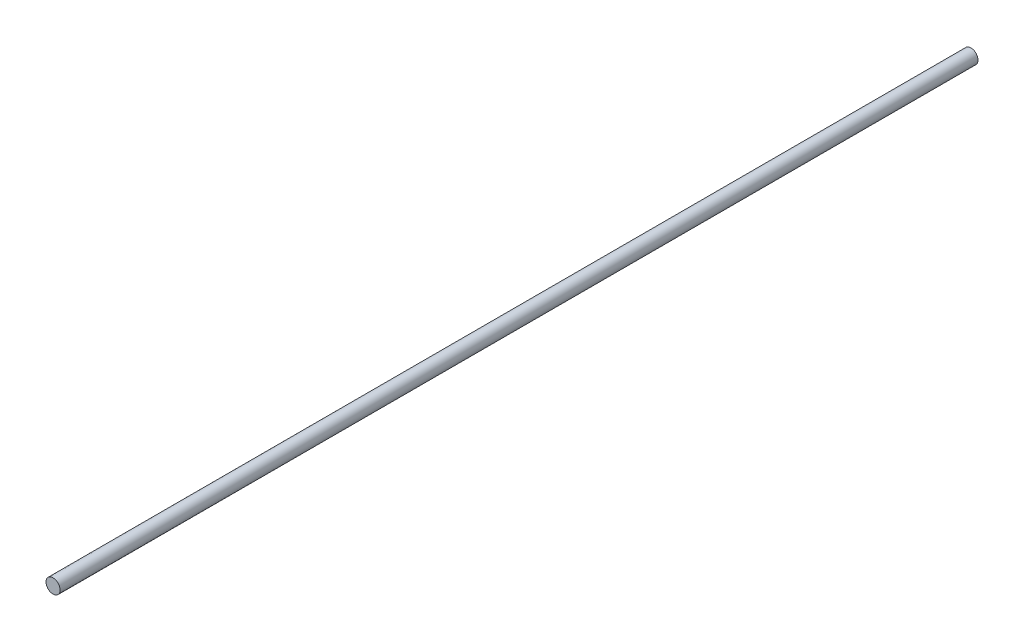
ISO-10303-21;
HEADER;
FILE_DESCRIPTION(('STEP AP214'),'2;1');
FILE_NAME('part.step','',(''),(''),'','','');
FILE_SCHEMA(('AUTOMOTIVE_DESIGN { 1 0 10303 214 1 1 1 1 }'));
ENDSEC;
DATA;
#1=APPLICATION_CONTEXT('core data for automotive mechanical design processes');
#2=APPLICATION_PROTOCOL_DEFINITION('international standard','automotive_design',2000,#1);
#3=PRODUCT_CONTEXT('',#1,'mechanical');
#4=PRODUCT('Part','Part','',(#3));
#5=PRODUCT_RELATED_PRODUCT_CATEGORY('part','',(#4));
#6=PRODUCT_DEFINITION_FORMATION('','',#4);
#7=PRODUCT_DEFINITION_CONTEXT('part definition',#1,'design');
#8=PRODUCT_DEFINITION('design','',#6,#7);
#9=PRODUCT_DEFINITION_SHAPE('','',#8);
#10=(LENGTH_UNIT() NAMED_UNIT(*) SI_UNIT(.MILLI.,.METRE.));
#11=(NAMED_UNIT(*) PLANE_ANGLE_UNIT() SI_UNIT($,.RADIAN.));
#12=(NAMED_UNIT(*) SI_UNIT($,.STERADIAN.) SOLID_ANGLE_UNIT());
#13=UNCERTAINTY_MEASURE_WITH_UNIT(LENGTH_MEASURE(1.E-05),#10,'distance_accuracy_value','');
#14=(GEOMETRIC_REPRESENTATION_CONTEXT(3) GLOBAL_UNCERTAINTY_ASSIGNED_CONTEXT((#13)) GLOBAL_UNIT_ASSIGNED_CONTEXT((#10,
#11,#12)) REPRESENTATION_CONTEXT('',''));
#15=CARTESIAN_POINT('',(0.,0.,0.));
#16=DIRECTION('',(0.,0.,1.));
#17=DIRECTION('',(1.,0.,0.));
#18=AXIS2_PLACEMENT_3D('',#15,#16,#17);
#19=CARTESIAN_POINT('',(-0.726888422359185,0.561376024676472,-13.));
#20=DIRECTION('',(0.,0.,1.));
#21=DIRECTION('',(1.,0.,0.));
#22=AXIS2_PLACEMENT_3D('',#19,#20,#21);
#23=CYLINDRICAL_SURFACE('',#22,1.1);
#24=CARTESIAN_POINT('',(-0.726888422359185,0.561376024676472,-13.));
#25=DIRECTION('',(0.,0.,1.));
#26=DIRECTION('',(1.,0.,0.));
#27=AXIS2_PLACEMENT_3D('',#24,#25,#26);
#28=CIRCLE('',#27,1.1);
#29=CARTESIAN_POINT('',(0.373111577640815,0.561376024676472,-13.));
#30=VERTEX_POINT('',#29);
#31=EDGE_CURVE('E10',#30,#30,#28,.T.);
#32=ORIENTED_EDGE('',*,*,#31,.T.);
#33=EDGE_LOOP('',(#32));
#34=FACE_BOUND('',#33,.T.);
#35=CARTESIAN_POINT('',(-0.726888422359185,0.561376024676472,130.));
#36=DIRECTION('',(0.,0.,1.));
#37=DIRECTION('',(1.,0.,0.));
#38=AXIS2_PLACEMENT_3D('',#35,#36,#37);
#39=CIRCLE('',#38,1.1);
#40=CARTESIAN_POINT('',(0.373111577640815,0.561376024676472,130.));
#41=VERTEX_POINT('',#40);
#42=EDGE_CURVE('E46',#41,#41,#39,.T.);
#43=ORIENTED_EDGE('',*,*,#42,.F.);
#44=EDGE_LOOP('',(#43));
#45=FACE_BOUND('',#44,.T.);
#46=ADVANCED_FACE('F39',(#34,#45),#23,.T.);
#47=CARTESIAN_POINT('',(-0.726888422359185,0.561376024676472,-13.));
#48=DIRECTION('',(0.,0.,1.));
#49=DIRECTION('',(1.,0.,0.));
#50=AXIS2_PLACEMENT_3D('',#47,#48,#49);
#51=PLANE('',#50);
#52=ORIENTED_EDGE('',*,*,#31,.F.);
#53=EDGE_LOOP('',(#52));
#54=FACE_BOUND('',#53,.T.);
#55=ADVANCED_FACE('F56',(#54),#51,.F.);
#56=CARTESIAN_POINT('',(-0.726888422359185,0.561376024676472,130.));
#57=DIRECTION('',(0.,0.,1.));
#58=DIRECTION('',(1.,0.,0.));
#59=AXIS2_PLACEMENT_3D('',#56,#57,#58);
#60=PLANE('',#59);
#61=ORIENTED_EDGE('',*,*,#42,.T.);
#62=EDGE_LOOP('',(#61));
#63=FACE_BOUND('',#62,.T.);
#64=ADVANCED_FACE('F53',(#63),#60,.T.);
#65=CLOSED_SHELL('',(#46,#55,#64));
#66=MANIFOLD_SOLID_BREP('B2',#65);
#67=ADVANCED_BREP_SHAPE_REPRESENTATION('',(#18,#66),#14);
#68=SHAPE_DEFINITION_REPRESENTATION(#9,#67);
ENDSEC;
END-ISO-10303-21;
